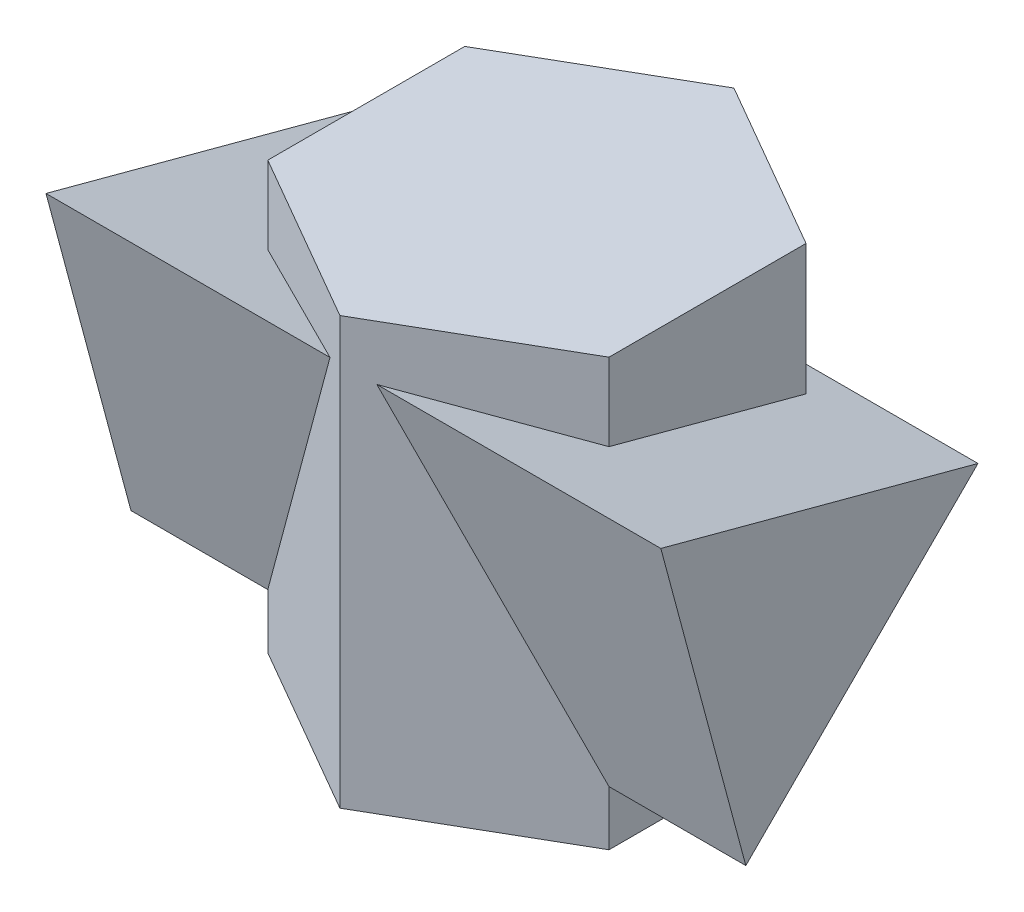
ISO-10303-21;
HEADER;
FILE_DESCRIPTION(('STEP AP214'),'2;1');
FILE_NAME('part.step','',(''),(''),'','','');
FILE_SCHEMA(('AUTOMOTIVE_DESIGN { 1 0 10303 214 1 1 1 1 }'));
ENDSEC;
DATA;
#1=APPLICATION_CONTEXT('core data for automotive mechanical design processes');
#2=APPLICATION_PROTOCOL_DEFINITION('international standard','automotive_design',2000,#1);
#3=PRODUCT_CONTEXT('',#1,'mechanical');
#4=PRODUCT('Part','Part','',(#3));
#5=PRODUCT_RELATED_PRODUCT_CATEGORY('part','',(#4));
#6=PRODUCT_DEFINITION_FORMATION('','',#4);
#7=PRODUCT_DEFINITION_CONTEXT('part definition',#1,'design');
#8=PRODUCT_DEFINITION('design','',#6,#7);
#9=PRODUCT_DEFINITION_SHAPE('','',#8);
#10=(LENGTH_UNIT() NAMED_UNIT(*) SI_UNIT(.MILLI.,.METRE.));
#11=(NAMED_UNIT(*) PLANE_ANGLE_UNIT() SI_UNIT($,.RADIAN.));
#12=(NAMED_UNIT(*) SI_UNIT($,.STERADIAN.) SOLID_ANGLE_UNIT());
#13=UNCERTAINTY_MEASURE_WITH_UNIT(LENGTH_MEASURE(1.E-05),#10,'distance_accuracy_value','');
#14=(GEOMETRIC_REPRESENTATION_CONTEXT(3) GLOBAL_UNCERTAINTY_ASSIGNED_CONTEXT((#13)) GLOBAL_UNIT_ASSIGNED_CONTEXT((#10,
#11,#12)) REPRESENTATION_CONTEXT('',''));
#15=CARTESIAN_POINT('',(0.,0.,0.));
#16=DIRECTION('',(0.,0.,1.));
#17=DIRECTION('',(1.,0.,0.));
#18=AXIS2_PLACEMENT_3D('',#15,#16,#17);
#19=CARTESIAN_POINT('',(31.1769145362398,77.96,-36.));
#20=DIRECTION('',(-0.5,0.,0.866025403784439));
#21=DIRECTION('',(0.866025403784438,0.,0.5));
#22=AXIS2_PLACEMENT_3D('',#19,#20,#21);
#23=PLANE('',#22);
#24=DIRECTION('',(-0.774596669241483,0.447213595499959,-0.447213595499958));
#25=VECTOR('',#24,1.);
#26=CARTESIAN_POINT('',(20.1056457742595,52.3920000000002,-42.392));
#27=LINE('',#26,#25);
#28=CARTESIAN_POINT('',(31.1769145362398,46.0000000000001,-36.));
#29=VERTEX_POINT('',#28);
#30=CARTESIAN_POINT('',(20.0460513252242,52.4264068711929,-42.4264068711928));
#31=VERTEX_POINT('',#30);
#32=EDGE_CURVE('E191',#29,#31,#27,.T.);
#33=ORIENTED_EDGE('',*,*,#32,.F.);
#34=DIRECTION('',(0.,-1.,0.));
#35=VECTOR('',#34,1.);
#36=CARTESIAN_POINT('',(31.1769145362398,77.96,-36.));
#37=LINE('',#36,#35);
#38=CARTESIAN_POINT('',(31.1769145362398,0.,-36.));
#39=VERTEX_POINT('',#38);
#40=EDGE_CURVE('E227',#29,#39,#37,.T.);
#41=ORIENTED_EDGE('',*,*,#40,.T.);
#42=DIRECTION('',(-0.866025403784439,0.,-0.5));
#43=VECTOR('',#42,1.);
#44=CARTESIAN_POINT('',(31.1769145362398,0.,-36.));
#45=LINE('',#44,#43);
#46=CARTESIAN_POINT('',(0.,0.,-54.));
#47=VERTEX_POINT('',#46);
#48=EDGE_CURVE('E197',#39,#47,#45,.T.);
#49=ORIENTED_EDGE('',*,*,#48,.T.);
#50=DIRECTION('',(0.,-1.,0.));
#51=VECTOR('',#50,1.);
#52=CARTESIAN_POINT('',(0.,77.96,-54.));
#53=LINE('',#52,#51);
#54=CARTESIAN_POINT('',(0.,77.96,-54.));
#55=VERTEX_POINT('',#54);
#56=EDGE_CURVE('E243',#55,#47,#53,.T.);
#57=ORIENTED_EDGE('',*,*,#56,.F.);
#58=DIRECTION('',(-0.866025403784439,0.,-0.5));
#59=VECTOR('',#58,1.);
#60=CARTESIAN_POINT('',(31.1769145362398,77.96,-36.));
#61=LINE('',#60,#59);
#62=CARTESIAN_POINT('',(31.1769145362398,77.96,-36.));
#63=VERTEX_POINT('',#62);
#64=EDGE_CURVE('E214',#63,#55,#61,.T.);
#65=ORIENTED_EDGE('',*,*,#64,.F.);
#66=CARTESIAN_POINT('',(31.1769145362398,54.1483574025628,-36.));
#67=VERTEX_POINT('',#66);
#68=EDGE_CURVE('E228',#63,#67,#37,.T.);
#69=ORIENTED_EDGE('',*,*,#68,.T.);
#70=DIRECTION('',(0.858356263574049,0.132788176096107,0.495572219835078));
#71=VECTOR('',#70,1.);
#72=CARTESIAN_POINT('',(33.890955146204,54.5682209461074,-34.4330479232456));
#73=LINE('',#72,#71);
#74=EDGE_CURVE('E44',#31,#67,#73,.T.);
#75=ORIENTED_EDGE('',*,*,#74,.F.);
#76=EDGE_LOOP('',(#33,#41,#49,#57,#65,#69,#75));
#77=FACE_BOUND('',#76,.T.);
#78=ADVANCED_FACE('F30',(#77),#23,.F.);
#79=CARTESIAN_POINT('',(0.,77.96,-54.));
#80=DIRECTION('',(0.5,0.,0.866025403784439));
#81=DIRECTION('',(0.866025403784439,0.,-0.5));
#82=AXIS2_PLACEMENT_3D('',#79,#80,#81);
#83=PLANE('',#82);
#84=DIRECTION('',(-0.774596669241483,-0.447213595499959,0.447213595499958));
#85=VECTOR('',#84,1.);
#86=CARTESIAN_POINT('',(4.83588585473225,66.7920000000002,-56.792));
#87=LINE('',#86,#85);
#88=CARTESIAN_POINT('',(-20.0460513252242,52.4264068711929,-42.4264068711928));
#89=VERTEX_POINT('',#88);
#90=CARTESIAN_POINT('',(-31.1769145362398,46.0000000000001,-36.));
#91=VERTEX_POINT('',#90);
#92=EDGE_CURVE('E52',#89,#91,#87,.T.);
#93=ORIENTED_EDGE('',*,*,#92,.F.);
#94=DIRECTION('',(0.858356263574049,-0.132788176096107,-0.495572219835079));
#95=VECTOR('',#94,1.);
#96=CARTESIAN_POINT('',(-3.2637737818951,49.8301795000099,-52.1156593284488));
#97=LINE('',#96,#95);
#98=CARTESIAN_POINT('',(-31.1769145362398,54.1483574025628,-36.));
#99=VERTEX_POINT('',#98);
#100=EDGE_CURVE('E189',#99,#89,#97,.T.);
#101=ORIENTED_EDGE('',*,*,#100,.F.);
#102=DIRECTION('',(0.,-1.,0.));
#103=VECTOR('',#102,1.);
#104=CARTESIAN_POINT('',(-31.1769145362398,77.96,-36.));
#105=LINE('',#104,#103);
#106=CARTESIAN_POINT('',(-31.1769145362398,77.96,-36.));
#107=VERTEX_POINT('',#106);
#108=EDGE_CURVE('E240',#107,#99,#105,.T.);
#109=ORIENTED_EDGE('',*,*,#108,.F.);
#110=DIRECTION('',(-0.866025403784439,0.,0.5));
#111=VECTOR('',#110,1.);
#112=CARTESIAN_POINT('',(0.,77.96,-54.));
#113=LINE('',#112,#111);
#114=EDGE_CURVE('E217',#55,#107,#113,.T.);
#115=ORIENTED_EDGE('',*,*,#114,.F.);
#116=ORIENTED_EDGE('',*,*,#56,.T.);
#117=DIRECTION('',(-0.866025403784439,0.,0.5));
#118=VECTOR('',#117,1.);
#119=CARTESIAN_POINT('',(0.,0.,-54.));
#120=LINE('',#119,#118);
#121=CARTESIAN_POINT('',(-31.1769145362398,0.,-36.));
#122=VERTEX_POINT('',#121);
#123=EDGE_CURVE('E200',#47,#122,#120,.T.);
#124=ORIENTED_EDGE('',*,*,#123,.T.);
#125=EDGE_CURVE('E239',#91,#122,#105,.T.);
#126=ORIENTED_EDGE('',*,*,#125,.F.);
#127=EDGE_LOOP('',(#93,#101,#109,#115,#116,#124,#126));
#128=FACE_BOUND('',#127,.T.);
#129=ADVANCED_FACE('F290',(#128),#83,.F.);
#130=CARTESIAN_POINT('',(-31.1769145362398,77.96,-36.));
#131=DIRECTION('',(1.,0.,0.));
#132=DIRECTION('',(0.,0.,-1.));
#133=AXIS2_PLACEMENT_3D('',#130,#131,#132);
#134=PLANE('',#133);
#135=DIRECTION('',(0.,-0.707106781186549,0.707106781186546));
#136=VECTOR('',#135,1.);
#137=CARTESIAN_POINT('',(-31.1769145362398,61.9800000000001,-51.9799999999999));
#138=LINE('',#137,#136);
#139=CARTESIAN_POINT('',(-31.1769145362398,10.,0.));
#140=VERTEX_POINT('',#139);
#141=EDGE_CURVE('E145',#91,#140,#138,.T.);
#142=ORIENTED_EDGE('',*,*,#141,.F.);
#143=ORIENTED_EDGE('',*,*,#125,.T.);
#144=DIRECTION('',(0.,0.,1.));
#145=VECTOR('',#144,1.);
#146=CARTESIAN_POINT('',(-31.1769145362398,0.,-36.));
#147=LINE('',#146,#145);
#148=CARTESIAN_POINT('',(-31.1769145362398,0.,0.));
#149=VERTEX_POINT('',#148);
#150=EDGE_CURVE('E203',#122,#149,#147,.T.);
#151=ORIENTED_EDGE('',*,*,#150,.T.);
#152=DIRECTION('',(0.,-1.,0.));
#153=VECTOR('',#152,1.);
#154=CARTESIAN_POINT('',(-31.1769145362398,77.96,0.));
#155=LINE('',#154,#153);
#156=EDGE_CURVE('E236',#140,#149,#155,.T.);
#157=ORIENTED_EDGE('',*,*,#156,.F.);
#158=EDGE_LOOP('',(#142,#143,#151,#157));
#159=FACE_BOUND('',#158,.T.);
#160=ADVANCED_FACE('F313',(#159),#134,.F.);
#161=DIRECTION('',(0.,-0.258819045102519,-0.965925826289069));
#162=VECTOR('',#161,1.);
#163=CARTESIAN_POINT('',(-31.1769145362398,55.7434350036733,-30.0470893506408));
#164=LINE('',#163,#162);
#165=CARTESIAN_POINT('',(-31.1769145362398,63.7945283300832,0.));
#166=VERTEX_POINT('',#165);
#167=EDGE_CURVE('E186',#166,#99,#164,.T.);
#168=ORIENTED_EDGE('',*,*,#167,.F.);
#169=CARTESIAN_POINT('',(-31.1769145362398,77.96,0.));
#170=VERTEX_POINT('',#169);
#171=EDGE_CURVE('E237',#170,#166,#155,.T.);
#172=ORIENTED_EDGE('',*,*,#171,.F.);
#173=DIRECTION('',(0.,0.,1.));
#174=VECTOR('',#173,1.);
#175=CARTESIAN_POINT('',(-31.1769145362398,77.96,-36.));
#176=LINE('',#175,#174);
#177=EDGE_CURVE('E219',#107,#170,#176,.T.);
#178=ORIENTED_EDGE('',*,*,#177,.F.);
#179=ORIENTED_EDGE('',*,*,#108,.T.);
#180=EDGE_LOOP('',(#168,#172,#178,#179));
#181=FACE_BOUND('',#180,.T.);
#182=ADVANCED_FACE('F294',(#181),#134,.F.);
#183=CARTESIAN_POINT('',(-31.1769145362398,77.96,0.));
#184=DIRECTION('',(0.5,0.,-0.866025403784439));
#185=DIRECTION('',(-0.866025403784439,0.,-0.5));
#186=AXIS2_PLACEMENT_3D('',#183,#184,#185);
#187=PLANE('',#186);
#188=DIRECTION('',(0.409064926172235,0.881412416655377,0.236173745241574));
#189=VECTOR('',#188,1.);
#190=CARTESIAN_POINT('',(-6.67360318248888,62.7972981660011,14.1469934061253));
#191=LINE('',#190,#189);
#192=CARTESIAN_POINT('',(-4.27965037119799,67.9555495773441,15.5291427061513));
#193=VERTEX_POINT('',#192);
#194=EDGE_CURVE('E195',#140,#193,#191,.T.);
#195=ORIENTED_EDGE('',*,*,#194,.F.);
#196=ORIENTED_EDGE('',*,*,#156,.T.);
#197=DIRECTION('',(0.866025403784439,0.,0.5));
#198=VECTOR('',#197,1.);
#199=CARTESIAN_POINT('',(-31.1769145362398,0.,0.));
#200=LINE('',#199,#198);
#201=CARTESIAN_POINT('',(0.,0.,18.));
#202=VERTEX_POINT('',#201);
#203=EDGE_CURVE('E206',#149,#202,#200,.T.);
#204=ORIENTED_EDGE('',*,*,#203,.T.);
#205=DIRECTION('',(0.,-1.,0.));
#206=VECTOR('',#205,1.);
#207=CARTESIAN_POINT('',(0.,77.96,18.));
#208=LINE('',#207,#206);
#209=CARTESIAN_POINT('',(0.,77.96,18.));
#210=VERTEX_POINT('',#209);
#211=EDGE_CURVE('E233',#210,#202,#208,.T.);
#212=ORIENTED_EDGE('',*,*,#211,.F.);
#213=DIRECTION('',(0.866025403784439,0.,0.5));
#214=VECTOR('',#213,1.);
#215=CARTESIAN_POINT('',(-31.1769145362398,77.96,0.));
#216=LINE('',#215,#214);
#217=EDGE_CURVE('E221',#170,#210,#216,.T.);
#218=ORIENTED_EDGE('',*,*,#217,.F.);
#219=ORIENTED_EDGE('',*,*,#171,.T.);
#220=DIRECTION('',(-0.858356263574049,-0.132788176096107,-0.495572219835078));
#221=VECTOR('',#220,1.);
#222=CARTESIAN_POINT('',(-29.5623402701373,64.0443038383025,0.932174887160916));
#223=LINE('',#222,#221);
#224=EDGE_CURVE('E183',#193,#166,#223,.T.);
#225=ORIENTED_EDGE('',*,*,#224,.F.);
#226=EDGE_LOOP('',(#195,#196,#204,#212,#218,#219,#225));
#227=FACE_BOUND('',#226,.T.);
#228=ADVANCED_FACE('F284',(#227),#187,.F.);
#229=CARTESIAN_POINT('',(0.,77.96,18.));
#230=DIRECTION('',(-0.5,0.,-0.866025403784439));
#231=DIRECTION('',(-0.866025403784439,0.,0.5));
#232=AXIS2_PLACEMENT_3D('',#229,#230,#231);
#233=PLANE('',#232);
#234=DIRECTION('',(0.409064926172235,-0.881412416655377,-0.236173745241574));
#235=VECTOR('',#234,1.);
#236=CARTESIAN_POINT('',(-0.282345305107788,77.7852841171639,18.1630121379084));
#237=LINE('',#236,#235);
#238=CARTESIAN_POINT('',(4.27965037119799,67.9555495773441,15.5291427061513));
#239=VERTEX_POINT('',#238);
#240=CARTESIAN_POINT('',(31.1769145362398,9.99999999999999,0.));
#241=VERTEX_POINT('',#240);
#242=EDGE_CURVE('E11',#239,#241,#237,.T.);
#243=ORIENTED_EDGE('',*,*,#242,.F.);
#244=DIRECTION('',(-0.858356263574049,0.132788176096107,0.495572219835078));
#245=VECTOR('',#244,1.);
#246=CARTESIAN_POINT('',(-1.06484109417163,68.7823452844001,18.6147862923642));
#247=LINE('',#246,#245);
#248=CARTESIAN_POINT('',(31.1769145362398,63.7945283300832,0.));
#249=VERTEX_POINT('',#248);
#250=EDGE_CURVE('E179',#249,#239,#247,.T.);
#251=ORIENTED_EDGE('',*,*,#250,.F.);
#252=DIRECTION('',(0.,-1.,0.));
#253=VECTOR('',#252,1.);
#254=CARTESIAN_POINT('',(31.1769145362398,77.96,0.));
#255=LINE('',#254,#253);
#256=CARTESIAN_POINT('',(31.1769145362398,77.96,0.));
#257=VERTEX_POINT('',#256);
#258=EDGE_CURVE('E231',#257,#249,#255,.T.);
#259=ORIENTED_EDGE('',*,*,#258,.F.);
#260=DIRECTION('',(0.866025403784439,0.,-0.5));
#261=VECTOR('',#260,1.);
#262=CARTESIAN_POINT('',(0.,77.96,18.));
#263=LINE('',#262,#261);
#264=EDGE_CURVE('E223',#210,#257,#263,.T.);
#265=ORIENTED_EDGE('',*,*,#264,.F.);
#266=ORIENTED_EDGE('',*,*,#211,.T.);
#267=DIRECTION('',(0.866025403784439,0.,-0.5));
#268=VECTOR('',#267,1.);
#269=CARTESIAN_POINT('',(0.,0.,18.));
#270=LINE('',#269,#268);
#271=CARTESIAN_POINT('',(31.1769145362398,0.,0.));
#272=VERTEX_POINT('',#271);
#273=EDGE_CURVE('E208',#202,#272,#270,.T.);
#274=ORIENTED_EDGE('',*,*,#273,.T.);
#275=EDGE_CURVE('E230',#241,#272,#255,.T.);
#276=ORIENTED_EDGE('',*,*,#275,.F.);
#277=EDGE_LOOP('',(#243,#251,#259,#265,#266,#274,#276));
#278=FACE_BOUND('',#277,.T.);
#279=ADVANCED_FACE('F258',(#278),#233,.F.);
#280=CARTESIAN_POINT('',(31.1769145362398,77.96,0.));
#281=DIRECTION('',(-1.,0.,0.));
#282=DIRECTION('',(0.,0.,1.));
#283=AXIS2_PLACEMENT_3D('',#280,#281,#282);
#284=PLANE('',#283);
#285=DIRECTION('',(0.,0.707106781186549,-0.707106781186546));
#286=VECTOR('',#285,1.);
#287=CARTESIAN_POINT('',(31.1769145362398,43.9800000000001,-33.98));
#288=LINE('',#287,#286);
#289=EDGE_CURVE('E37',#241,#29,#288,.T.);
#290=ORIENTED_EDGE('',*,*,#289,.F.);
#291=ORIENTED_EDGE('',*,*,#275,.T.);
#292=DIRECTION('',(0.,0.,-1.));
#293=VECTOR('',#292,1.);
#294=CARTESIAN_POINT('',(31.1769145362398,0.,0.));
#295=LINE('',#294,#293);
#296=EDGE_CURVE('E211',#272,#39,#295,.T.);
#297=ORIENTED_EDGE('',*,*,#296,.T.);
#298=ORIENTED_EDGE('',*,*,#40,.F.);
#299=EDGE_LOOP('',(#290,#291,#297,#298));
#300=FACE_BOUND('',#299,.T.);
#301=ADVANCED_FACE('F256',(#300),#284,.F.);
#302=DIRECTION('',(0.,0.258819045102519,0.965925826289069));
#303=VECTOR('',#302,1.);
#304=CARTESIAN_POINT('',(31.1769145362398,64.7434350036732,3.54136791747918));
#305=LINE('',#304,#303);
#306=EDGE_CURVE('E246',#67,#249,#305,.T.);
#307=ORIENTED_EDGE('',*,*,#306,.F.);
#308=ORIENTED_EDGE('',*,*,#68,.F.);
#309=DIRECTION('',(0.,0.,-1.));
#310=VECTOR('',#309,1.);
#311=CARTESIAN_POINT('',(31.1769145362398,77.96,0.));
#312=LINE('',#311,#310);
#313=EDGE_CURVE('E225',#257,#63,#312,.T.);
#314=ORIENTED_EDGE('',*,*,#313,.F.);
#315=ORIENTED_EDGE('',*,*,#258,.T.);
#316=EDGE_LOOP('',(#307,#308,#314,#315));
#317=FACE_BOUND('',#316,.T.);
#318=ADVANCED_FACE('F274',(#317),#284,.F.);
#319=CARTESIAN_POINT('',(0.,77.96,-54.));
#320=DIRECTION('',(0.,1.,0.));
#321=DIRECTION('',(0.,0.,1.));
#322=AXIS2_PLACEMENT_3D('',#319,#320,#321);
#323=PLANE('',#322);
#324=ORIENTED_EDGE('',*,*,#64,.T.);
#325=ORIENTED_EDGE('',*,*,#114,.T.);
#326=ORIENTED_EDGE('',*,*,#177,.T.);
#327=ORIENTED_EDGE('',*,*,#217,.T.);
#328=ORIENTED_EDGE('',*,*,#264,.T.);
#329=ORIENTED_EDGE('',*,*,#313,.T.);
#330=EDGE_LOOP('',(#324,#325,#326,#327,#328,#329));
#331=FACE_BOUND('',#330,.T.);
#332=ADVANCED_FACE('F277',(#331),#323,.T.);
#333=CARTESIAN_POINT('',(0.,0.,-54.));
#334=DIRECTION('',(0.,1.,0.));
#335=DIRECTION('',(0.,0.,1.));
#336=AXIS2_PLACEMENT_3D('',#333,#334,#335);
#337=PLANE('',#336);
#338=ORIENTED_EDGE('',*,*,#48,.F.);
#339=ORIENTED_EDGE('',*,*,#296,.F.);
#340=ORIENTED_EDGE('',*,*,#273,.F.);
#341=ORIENTED_EDGE('',*,*,#203,.F.);
#342=ORIENTED_EDGE('',*,*,#150,.F.);
#343=ORIENTED_EDGE('',*,*,#123,.F.);
#344=EDGE_LOOP('',(#338,#339,#340,#341,#342,#343));
#345=FACE_BOUND('',#344,.T.);
#346=ADVANCED_FACE('F288',(#345),#337,.F.);
#347=CARTESIAN_POINT('',(56.175,10.,0.));
#348=DIRECTION('',(1.,0.,0.));
#349=DIRECTION('',(0.,0.,-1.));
#350=AXIS2_PLACEMENT_3D('',#347,#348,#349);
#351=PLANE('',#350);
#352=DIRECTION('',(0.,-0.965925826289068,-0.258819045102523));
#353=VECTOR('',#352,1.);
#354=CARTESIAN_POINT('',(56.175,67.9555495773441,15.5291427061513));
#355=LINE('',#354,#353);
#356=CARTESIAN_POINT('',(56.175,67.9555495773441,15.5291427061513));
#357=VERTEX_POINT('',#356);
#358=CARTESIAN_POINT('',(56.175,10.,0.));
#359=VERTEX_POINT('',#358);
#360=EDGE_CURVE('E165',#357,#359,#355,.T.);
#361=ORIENTED_EDGE('',*,*,#360,.T.);
#362=DIRECTION('',(0.,0.707106781186549,-0.707106781186546));
#363=VECTOR('',#362,1.);
#364=CARTESIAN_POINT('',(56.175,10.,0.));
#365=LINE('',#364,#363);
#366=CARTESIAN_POINT('',(56.175,52.4264068711929,-42.4264068711928));
#367=VERTEX_POINT('',#366);
#368=EDGE_CURVE('E168',#359,#367,#365,.T.);
#369=ORIENTED_EDGE('',*,*,#368,.T.);
#370=DIRECTION('',(0.,0.258819045102519,0.965925826289069));
#371=VECTOR('',#370,1.);
#372=CARTESIAN_POINT('',(56.175,52.4264068711929,-42.4264068711928));
#373=LINE('',#372,#371);
#374=EDGE_CURVE('E170',#367,#357,#373,.T.);
#375=ORIENTED_EDGE('',*,*,#374,.T.);
#376=EDGE_LOOP('',(#361,#369,#375));
#377=FACE_BOUND('',#376,.T.);
#378=ADVANCED_FACE('F308',(#377),#351,.T.);
#379=CARTESIAN_POINT('',(56.175,52.4264068711929,-42.4264068711928));
#380=DIRECTION('',(0.,-0.965925826289069,0.258819045102519));
#381=DIRECTION('',(0.,-0.258819045102519,-0.965925826289069));
#382=AXIS2_PLACEMENT_3D('',#379,#380,#381);
#383=PLANE('',#382);
#384=DIRECTION('',(-1.,0.,0.));
#385=VECTOR('',#384,1.);
#386=CARTESIAN_POINT('',(56.175,52.4264068711929,-42.4264068711928));
#387=LINE('',#386,#385);
#388=EDGE_CURVE('E150',#367,#31,#387,.T.);
#389=ORIENTED_EDGE('',*,*,#388,.T.);
#390=ORIENTED_EDGE('',*,*,#74,.T.);
#391=ORIENTED_EDGE('',*,*,#306,.T.);
#392=ORIENTED_EDGE('',*,*,#250,.T.);
#393=DIRECTION('',(-1.,0.,0.));
#394=VECTOR('',#393,1.);
#395=CARTESIAN_POINT('',(56.175,67.9555495773441,15.5291427061513));
#396=LINE('',#395,#394);
#397=EDGE_CURVE('E172',#357,#239,#396,.T.);
#398=ORIENTED_EDGE('',*,*,#397,.F.);
#399=ORIENTED_EDGE('',*,*,#374,.F.);
#400=EDGE_LOOP('',(#389,#390,#391,#392,#398,#399));
#401=FACE_BOUND('',#400,.T.);
#402=ADVANCED_FACE('F268',(#401),#383,.F.);
#403=CARTESIAN_POINT('',(56.175,10.,0.));
#404=DIRECTION('',(0.,0.707106781186546,0.707106781186549));
#405=DIRECTION('',(0.,-0.707106781186549,0.707106781186546));
#406=AXIS2_PLACEMENT_3D('',#403,#404,#405);
#407=PLANE('',#406);
#408=ORIENTED_EDGE('',*,*,#289,.T.);
#409=ORIENTED_EDGE('',*,*,#32,.T.);
#410=ORIENTED_EDGE('',*,*,#388,.F.);
#411=ORIENTED_EDGE('',*,*,#368,.F.);
#412=DIRECTION('',(-1.,0.,0.));
#413=VECTOR('',#412,1.);
#414=CARTESIAN_POINT('',(56.175,10.,0.));
#415=LINE('',#414,#413);
#416=EDGE_CURVE('E149',#359,#241,#415,.T.);
#417=ORIENTED_EDGE('',*,*,#416,.T.);
#418=EDGE_LOOP('',(#408,#409,#410,#411,#417));
#419=FACE_BOUND('',#418,.T.);
#420=ADVANCED_FACE('F250',(#419),#407,.F.);
#421=CARTESIAN_POINT('',(56.175,67.9555495773441,15.5291427061513));
#422=DIRECTION('',(0.,0.258819045102523,-0.965925826289068));
#423=DIRECTION('',(0.,0.965925826289068,0.258819045102523));
#424=AXIS2_PLACEMENT_3D('',#421,#422,#423);
#425=PLANE('',#424);
#426=ORIENTED_EDGE('',*,*,#397,.T.);
#427=ORIENTED_EDGE('',*,*,#242,.T.);
#428=ORIENTED_EDGE('',*,*,#416,.F.);
#429=ORIENTED_EDGE('',*,*,#360,.F.);
#430=EDGE_LOOP('',(#426,#427,#428,#429));
#431=FACE_BOUND('',#430,.T.);
#432=ADVANCED_FACE('F263',(#431),#425,.F.);
#433=CARTESIAN_POINT('',(-56.175,10.,0.));
#434=VERTEX_POINT('',#433);
#435=EDGE_CURVE('E139',#140,#434,#415,.T.);
#436=ORIENTED_EDGE('',*,*,#435,.F.);
#437=ORIENTED_EDGE('',*,*,#194,.T.);
#438=CARTESIAN_POINT('',(-56.175,67.9555495773441,15.5291427061513));
#439=VERTEX_POINT('',#438);
#440=EDGE_CURVE('E161',#193,#439,#396,.T.);
#441=ORIENTED_EDGE('',*,*,#440,.T.);
#442=DIRECTION('',(0.,-0.965925826289068,-0.258819045102523));
#443=VECTOR('',#442,1.);
#444=CARTESIAN_POINT('',(-56.175,67.9555495773441,15.5291427061513));
#445=LINE('',#444,#443);
#446=EDGE_CURVE('E155',#439,#434,#445,.T.);
#447=ORIENTED_EDGE('',*,*,#446,.T.);
#448=EDGE_LOOP('',(#436,#437,#441,#447));
#449=FACE_BOUND('',#448,.T.);
#450=ADVANCED_FACE('F159',(#449),#425,.F.);
#451=CARTESIAN_POINT('',(-56.175,52.4264068711929,-42.4264068711928));
#452=VERTEX_POINT('',#451);
#453=EDGE_CURVE('E175',#89,#452,#387,.T.);
#454=ORIENTED_EDGE('',*,*,#453,.F.);
#455=ORIENTED_EDGE('',*,*,#92,.T.);
#456=ORIENTED_EDGE('',*,*,#141,.T.);
#457=ORIENTED_EDGE('',*,*,#435,.T.);
#458=DIRECTION('',(0.,0.707106781186549,-0.707106781186546));
#459=VECTOR('',#458,1.);
#460=CARTESIAN_POINT('',(-56.175,10.,0.));
#461=LINE('',#460,#459);
#462=EDGE_CURVE('E143',#434,#452,#461,.T.);
#463=ORIENTED_EDGE('',*,*,#462,.T.);
#464=EDGE_LOOP('',(#454,#455,#456,#457,#463));
#465=FACE_BOUND('',#464,.T.);
#466=ADVANCED_FACE('F142',(#465),#407,.F.);
#467=ORIENTED_EDGE('',*,*,#167,.T.);
#468=ORIENTED_EDGE('',*,*,#100,.T.);
#469=ORIENTED_EDGE('',*,*,#453,.T.);
#470=DIRECTION('',(0.,0.258819045102519,0.965925826289069));
#471=VECTOR('',#470,1.);
#472=CARTESIAN_POINT('',(-56.175,52.4264068711929,-42.4264068711928));
#473=LINE('',#472,#471);
#474=EDGE_CURVE('E157',#452,#439,#473,.T.);
#475=ORIENTED_EDGE('',*,*,#474,.T.);
#476=ORIENTED_EDGE('',*,*,#440,.F.);
#477=ORIENTED_EDGE('',*,*,#224,.T.);
#478=EDGE_LOOP('',(#467,#468,#469,#475,#476,#477));
#479=FACE_BOUND('',#478,.T.);
#480=ADVANCED_FACE('F297',(#479),#383,.F.);
#481=CARTESIAN_POINT('',(-56.175,10.,0.));
#482=DIRECTION('',(1.,0.,0.));
#483=DIRECTION('',(0.,0.,-1.));
#484=AXIS2_PLACEMENT_3D('',#481,#482,#483);
#485=PLANE('',#484);
#486=ORIENTED_EDGE('',*,*,#446,.F.);
#487=ORIENTED_EDGE('',*,*,#474,.F.);
#488=ORIENTED_EDGE('',*,*,#462,.F.);
#489=EDGE_LOOP('',(#486,#487,#488));
#490=FACE_BOUND('',#489,.T.);
#491=ADVANCED_FACE('F154',(#490),#485,.F.);
#492=CLOSED_SHELL('',(#78,#129,#160,#182,#228,#279,#301,#318,#332,#346,#378,#402,#420,#432,#450,
#466,#480,#491));
#493=MANIFOLD_SOLID_BREP('B2',#492);
#494=ADVANCED_BREP_SHAPE_REPRESENTATION('',(#18,#493),#14);
#495=SHAPE_DEFINITION_REPRESENTATION(#9,#494);
ENDSEC;
END-ISO-10303-21;
